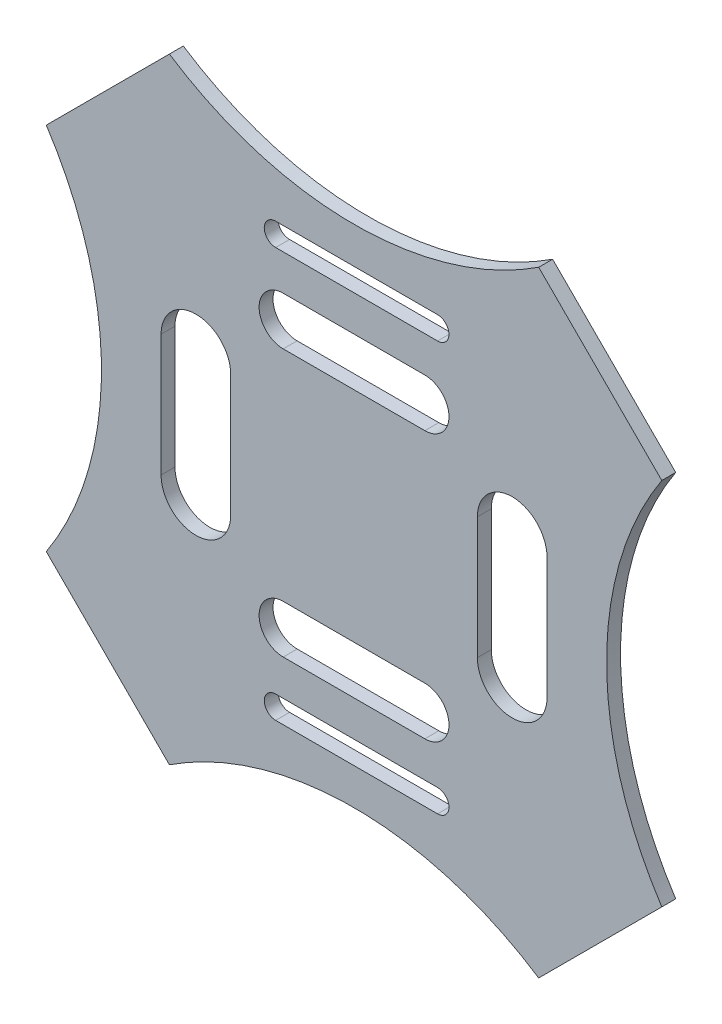
ISO-10303-21;
HEADER;
FILE_DESCRIPTION(('STEP AP214'),'2;1');
FILE_NAME('part.step','',(''),(''),'','','');
FILE_SCHEMA(('AUTOMOTIVE_DESIGN { 1 0 10303 214 1 1 1 1 }'));
ENDSEC;
DATA;
#1=APPLICATION_CONTEXT('core data for automotive mechanical design processes');
#2=APPLICATION_PROTOCOL_DEFINITION('international standard','automotive_design',2000,#1);
#3=PRODUCT_CONTEXT('',#1,'mechanical');
#4=PRODUCT('Part','Part','',(#3));
#5=PRODUCT_RELATED_PRODUCT_CATEGORY('part','',(#4));
#6=PRODUCT_DEFINITION_FORMATION('','',#4);
#7=PRODUCT_DEFINITION_CONTEXT('part definition',#1,'design');
#8=PRODUCT_DEFINITION('design','',#6,#7);
#9=PRODUCT_DEFINITION_SHAPE('','',#8);
#10=(LENGTH_UNIT() NAMED_UNIT(*) SI_UNIT(.MILLI.,.METRE.));
#11=(NAMED_UNIT(*) PLANE_ANGLE_UNIT() SI_UNIT($,.RADIAN.));
#12=(NAMED_UNIT(*) SI_UNIT($,.STERADIAN.) SOLID_ANGLE_UNIT());
#13=UNCERTAINTY_MEASURE_WITH_UNIT(LENGTH_MEASURE(1.E-05),#10,'distance_accuracy_value','');
#14=(GEOMETRIC_REPRESENTATION_CONTEXT(3) GLOBAL_UNCERTAINTY_ASSIGNED_CONTEXT((#13)) GLOBAL_UNIT_ASSIGNED_CONTEXT((#10,
#11,#12)) REPRESENTATION_CONTEXT('',''));
#15=CARTESIAN_POINT('',(0.,0.,0.));
#16=DIRECTION('',(0.,0.,1.));
#17=DIRECTION('',(1.,0.,0.));
#18=AXIS2_PLACEMENT_3D('',#15,#16,#17);
#19=CARTESIAN_POINT('',(0.,84.5998532410874,2.));
#20=DIRECTION('',(0.,0.,-1.));
#21=DIRECTION('',(-1.,0.,0.));
#22=AXIS2_PLACEMENT_3D('',#19,#20,#21);
#23=CYLINDRICAL_SURFACE('',#22,48.3295347499184);
#24=CARTESIAN_POINT('',(0.,84.5998532410874,0.));
#25=DIRECTION('',(0.,0.,1.));
#26=DIRECTION('',(1.,0.,0.));
#27=AXIS2_PLACEMENT_3D('',#24,#25,#26);
#28=CIRCLE('',#27,48.3295347499184);
#29=CARTESIAN_POINT('',(-26.5165042944955,44.1941738241592,0.));
#30=VERTEX_POINT('',#29);
#31=CARTESIAN_POINT('',(26.5165042944955,44.1941738241592,0.));
#32=VERTEX_POINT('',#31);
#33=EDGE_CURVE('E426',#30,#32,#28,.T.);
#34=ORIENTED_EDGE('',*,*,#33,.F.);
#35=DIRECTION('',(0.,0.,-1.));
#36=VECTOR('',#35,1.);
#37=CARTESIAN_POINT('',(-26.5165042944955,44.1941738241592,2.));
#38=LINE('',#37,#36);
#39=CARTESIAN_POINT('',(-26.5165042944955,44.1941738241592,2.));
#40=VERTEX_POINT('',#39);
#41=EDGE_CURVE('E11',#40,#30,#38,.T.);
#42=ORIENTED_EDGE('',*,*,#41,.F.);
#43=CARTESIAN_POINT('',(0.,84.5998532410874,2.));
#44=DIRECTION('',(0.,0.,1.));
#45=DIRECTION('',(1.,0.,0.));
#46=AXIS2_PLACEMENT_3D('',#43,#44,#45);
#47=CIRCLE('',#46,48.3295347499184);
#48=CARTESIAN_POINT('',(26.5165042944955,44.1941738241592,2.));
#49=VERTEX_POINT('',#48);
#50=EDGE_CURVE('E427',#40,#49,#47,.T.);
#51=ORIENTED_EDGE('',*,*,#50,.T.);
#52=DIRECTION('',(0.,0.,-1.));
#53=VECTOR('',#52,1.);
#54=CARTESIAN_POINT('',(26.5165042944955,44.1941738241592,2.));
#55=LINE('',#54,#53);
#56=EDGE_CURVE('E448',#49,#32,#55,.T.);
#57=ORIENTED_EDGE('',*,*,#56,.T.);
#58=EDGE_LOOP('',(#34,#42,#51,#57));
#59=FACE_BOUND('',#58,.T.);
#60=ADVANCED_FACE('F39',(#59),#23,.F.);
#61=CARTESIAN_POINT('',(-35.3553390593274,35.3553390593274,2.));
#62=DIRECTION('',(0.707106781186548,-0.707106781186547,0.));
#63=DIRECTION('',(0.707106781186547,0.707106781186548,0.));
#64=AXIS2_PLACEMENT_3D('',#61,#62,#63);
#65=PLANE('',#64);
#66=DIRECTION('',(-0.707106781186547,-0.707106781186548,0.));
#67=VECTOR('',#66,1.);
#68=CARTESIAN_POINT('',(-35.3553390593274,35.3553390593274,0.));
#69=LINE('',#68,#67);
#70=CARTESIAN_POINT('',(-44.1941738241592,26.5165042944955,0.));
#71=VERTEX_POINT('',#70);
#72=EDGE_CURVE('E451',#30,#71,#69,.T.);
#73=ORIENTED_EDGE('',*,*,#72,.T.);
#74=DIRECTION('',(0.,0.,-1.));
#75=VECTOR('',#74,1.);
#76=CARTESIAN_POINT('',(-44.1941738241592,26.5165042944955,2.));
#77=LINE('',#76,#75);
#78=CARTESIAN_POINT('',(-44.1941738241592,26.5165042944955,2.));
#79=VERTEX_POINT('',#78);
#80=EDGE_CURVE('E46',#79,#71,#77,.T.);
#81=ORIENTED_EDGE('',*,*,#80,.F.);
#82=DIRECTION('',(-0.707106781186547,-0.707106781186548,0.));
#83=VECTOR('',#82,1.);
#84=CARTESIAN_POINT('',(-35.3553390593274,35.3553390593274,2.));
#85=LINE('',#84,#83);
#86=EDGE_CURVE('E430',#40,#79,#85,.T.);
#87=ORIENTED_EDGE('',*,*,#86,.F.);
#88=ORIENTED_EDGE('',*,*,#41,.T.);
#89=EDGE_LOOP('',(#73,#81,#87,#88));
#90=FACE_BOUND('',#89,.T.);
#91=ADVANCED_FACE('F504',(#90),#65,.F.);
#92=CARTESIAN_POINT('',(-84.5998532410874,0.,2.));
#93=DIRECTION('',(0.,0.,-1.));
#94=DIRECTION('',(-1.,0.,0.));
#95=AXIS2_PLACEMENT_3D('',#92,#93,#94);
#96=CYLINDRICAL_SURFACE('',#95,48.3295347499185);
#97=CARTESIAN_POINT('',(-84.5998532410874,0.,0.));
#98=DIRECTION('',(0.,0.,1.));
#99=DIRECTION('',(1.,0.,0.));
#100=AXIS2_PLACEMENT_3D('',#97,#98,#99);
#101=CIRCLE('',#100,48.3295347499185);
#102=CARTESIAN_POINT('',(-44.1941738241592,-26.5165042944955,0.));
#103=VERTEX_POINT('',#102);
#104=EDGE_CURVE('E453',#71,#103,#101,.F.);
#105=ORIENTED_EDGE('',*,*,#104,.T.);
#106=DIRECTION('',(0.,0.,-1.));
#107=VECTOR('',#106,1.);
#108=CARTESIAN_POINT('',(-44.1941738241592,-26.5165042944955,2.));
#109=LINE('',#108,#107);
#110=CARTESIAN_POINT('',(-44.1941738241592,-26.5165042944955,2.));
#111=VERTEX_POINT('',#110);
#112=EDGE_CURVE('E479',#111,#103,#109,.T.);
#113=ORIENTED_EDGE('',*,*,#112,.F.);
#114=CARTESIAN_POINT('',(-84.5998532410874,0.,2.));
#115=DIRECTION('',(0.,0.,1.));
#116=DIRECTION('',(1.,0.,0.));
#117=AXIS2_PLACEMENT_3D('',#114,#115,#116);
#118=CIRCLE('',#117,48.3295347499185);
#119=EDGE_CURVE('E433',#79,#111,#118,.F.);
#120=ORIENTED_EDGE('',*,*,#119,.F.);
#121=ORIENTED_EDGE('',*,*,#80,.T.);
#122=EDGE_LOOP('',(#105,#113,#120,#121));
#123=FACE_BOUND('',#122,.T.);
#124=ADVANCED_FACE('F485',(#123),#96,.F.);
#125=CARTESIAN_POINT('',(-35.3553390593274,-35.3553390593274,2.));
#126=DIRECTION('',(-0.707106781186547,-0.707106781186548,0.));
#127=DIRECTION('',(0.707106781186548,-0.707106781186547,0.));
#128=AXIS2_PLACEMENT_3D('',#125,#126,#127);
#129=PLANE('',#128);
#130=DIRECTION('',(-0.707106781186548,0.707106781186547,0.));
#131=VECTOR('',#130,1.);
#132=CARTESIAN_POINT('',(-35.3553390593274,-35.3553390593274,0.));
#133=LINE('',#132,#131);
#134=CARTESIAN_POINT('',(-26.5165042944955,-44.1941738241592,0.));
#135=VERTEX_POINT('',#134);
#136=EDGE_CURVE('E456',#135,#103,#133,.T.);
#137=ORIENTED_EDGE('',*,*,#136,.F.);
#138=DIRECTION('',(0.,0.,-1.));
#139=VECTOR('',#138,1.);
#140=CARTESIAN_POINT('',(-26.5165042944955,-44.1941738241592,2.));
#141=LINE('',#140,#139);
#142=CARTESIAN_POINT('',(-26.5165042944955,-44.1941738241592,2.));
#143=VERTEX_POINT('',#142);
#144=EDGE_CURVE('E477',#143,#135,#141,.T.);
#145=ORIENTED_EDGE('',*,*,#144,.F.);
#146=DIRECTION('',(-0.707106781186548,0.707106781186547,0.));
#147=VECTOR('',#146,1.);
#148=CARTESIAN_POINT('',(-35.3553390593274,-35.3553390593274,2.));
#149=LINE('',#148,#147);
#150=EDGE_CURVE('E435',#143,#111,#149,.T.);
#151=ORIENTED_EDGE('',*,*,#150,.T.);
#152=ORIENTED_EDGE('',*,*,#112,.T.);
#153=EDGE_LOOP('',(#137,#145,#151,#152));
#154=FACE_BOUND('',#153,.T.);
#155=ADVANCED_FACE('F496',(#154),#129,.T.);
#156=CARTESIAN_POINT('',(0.,-84.5998532410874,2.));
#157=DIRECTION('',(0.,0.,-1.));
#158=DIRECTION('',(-1.,0.,0.));
#159=AXIS2_PLACEMENT_3D('',#156,#157,#158);
#160=CYLINDRICAL_SURFACE('',#159,48.3295347499185);
#161=CARTESIAN_POINT('',(0.,-84.5998532410874,0.));
#162=DIRECTION('',(0.,0.,1.));
#163=DIRECTION('',(1.,0.,0.));
#164=AXIS2_PLACEMENT_3D('',#161,#162,#163);
#165=CIRCLE('',#164,48.3295347499185);
#166=CARTESIAN_POINT('',(26.5165042944955,-44.1941738241592,0.));
#167=VERTEX_POINT('',#166);
#168=EDGE_CURVE('E459',#135,#167,#165,.F.);
#169=ORIENTED_EDGE('',*,*,#168,.T.);
#170=DIRECTION('',(0.,0.,-1.));
#171=VECTOR('',#170,1.);
#172=CARTESIAN_POINT('',(26.5165042944955,-44.1941738241592,2.));
#173=LINE('',#172,#171);
#174=CARTESIAN_POINT('',(26.5165042944955,-44.1941738241592,2.));
#175=VERTEX_POINT('',#174);
#176=EDGE_CURVE('E474',#175,#167,#173,.T.);
#177=ORIENTED_EDGE('',*,*,#176,.F.);
#178=CARTESIAN_POINT('',(0.,-84.5998532410874,2.));
#179=DIRECTION('',(0.,0.,1.));
#180=DIRECTION('',(1.,0.,0.));
#181=AXIS2_PLACEMENT_3D('',#178,#179,#180);
#182=CIRCLE('',#181,48.3295347499185);
#183=EDGE_CURVE('E438',#143,#175,#182,.F.);
#184=ORIENTED_EDGE('',*,*,#183,.F.);
#185=ORIENTED_EDGE('',*,*,#144,.T.);
#186=EDGE_LOOP('',(#169,#177,#184,#185));
#187=FACE_BOUND('',#186,.T.);
#188=ADVANCED_FACE('F518',(#187),#160,.F.);
#189=CARTESIAN_POINT('',(35.3553390593274,-35.3553390593274,2.));
#190=DIRECTION('',(-0.707106781186548,0.707106781186547,0.));
#191=DIRECTION('',(-0.707106781186547,-0.707106781186548,0.));
#192=AXIS2_PLACEMENT_3D('',#189,#190,#191);
#193=PLANE('',#192);
#194=DIRECTION('',(0.707106781186547,0.707106781186548,0.));
#195=VECTOR('',#194,1.);
#196=CARTESIAN_POINT('',(35.3553390593274,-35.3553390593274,0.));
#197=LINE('',#196,#195);
#198=CARTESIAN_POINT('',(44.1941738241592,-26.5165042944955,0.));
#199=VERTEX_POINT('',#198);
#200=EDGE_CURVE('E461',#167,#199,#197,.T.);
#201=ORIENTED_EDGE('',*,*,#200,.T.);
#202=DIRECTION('',(0.,0.,-1.));
#203=VECTOR('',#202,1.);
#204=CARTESIAN_POINT('',(44.1941738241592,-26.5165042944955,2.));
#205=LINE('',#204,#203);
#206=CARTESIAN_POINT('',(44.1941738241592,-26.5165042944955,2.));
#207=VERTEX_POINT('',#206);
#208=EDGE_CURVE('E472',#207,#199,#205,.T.);
#209=ORIENTED_EDGE('',*,*,#208,.F.);
#210=DIRECTION('',(0.707106781186547,0.707106781186548,0.));
#211=VECTOR('',#210,1.);
#212=CARTESIAN_POINT('',(35.3553390593274,-35.3553390593274,2.));
#213=LINE('',#212,#211);
#214=EDGE_CURVE('E440',#175,#207,#213,.T.);
#215=ORIENTED_EDGE('',*,*,#214,.F.);
#216=ORIENTED_EDGE('',*,*,#176,.T.);
#217=EDGE_LOOP('',(#201,#209,#215,#216));
#218=FACE_BOUND('',#217,.T.);
#219=ADVANCED_FACE('F515',(#218),#193,.F.);
#220=CARTESIAN_POINT('',(84.5998532410874,0.,2.));
#221=DIRECTION('',(0.,0.,-1.));
#222=DIRECTION('',(-1.,0.,0.));
#223=AXIS2_PLACEMENT_3D('',#220,#221,#222);
#224=CYLINDRICAL_SURFACE('',#223,48.3295347499184);
#225=CARTESIAN_POINT('',(84.5998532410874,0.,0.));
#226=DIRECTION('',(0.,0.,1.));
#227=DIRECTION('',(1.,0.,0.));
#228=AXIS2_PLACEMENT_3D('',#225,#226,#227);
#229=CIRCLE('',#228,48.3295347499184);
#230=CARTESIAN_POINT('',(44.1941738241592,26.5165042944956,0.));
#231=VERTEX_POINT('',#230);
#232=EDGE_CURVE('E464',#231,#199,#229,.T.);
#233=ORIENTED_EDGE('',*,*,#232,.F.);
#234=DIRECTION('',(0.,0.,-1.));
#235=VECTOR('',#234,1.);
#236=CARTESIAN_POINT('',(44.1941738241592,26.5165042944956,2.));
#237=LINE('',#236,#235);
#238=CARTESIAN_POINT('',(44.1941738241592,26.5165042944956,2.));
#239=VERTEX_POINT('',#238);
#240=EDGE_CURVE('E470',#239,#231,#237,.T.);
#241=ORIENTED_EDGE('',*,*,#240,.F.);
#242=CARTESIAN_POINT('',(84.5998532410874,0.,2.));
#243=DIRECTION('',(0.,0.,1.));
#244=DIRECTION('',(1.,0.,0.));
#245=AXIS2_PLACEMENT_3D('',#242,#243,#244);
#246=CIRCLE('',#245,48.3295347499184);
#247=EDGE_CURVE('E442',#239,#207,#246,.T.);
#248=ORIENTED_EDGE('',*,*,#247,.T.);
#249=ORIENTED_EDGE('',*,*,#208,.T.);
#250=EDGE_LOOP('',(#233,#241,#248,#249));
#251=FACE_BOUND('',#250,.T.);
#252=ADVANCED_FACE('F512',(#251),#224,.F.);
#253=CARTESIAN_POINT('',(35.3553390593274,35.3553390593274,2.));
#254=DIRECTION('',(0.707106781186547,0.707106781186548,0.));
#255=DIRECTION('',(-0.707106781186548,0.707106781186547,0.));
#256=AXIS2_PLACEMENT_3D('',#253,#254,#255);
#257=PLANE('',#256);
#258=DIRECTION('',(0.707106781186548,-0.707106781186547,0.));
#259=VECTOR('',#258,1.);
#260=CARTESIAN_POINT('',(35.3553390593274,35.3553390593274,0.));
#261=LINE('',#260,#259);
#262=EDGE_CURVE('E431',#32,#231,#261,.T.);
#263=ORIENTED_EDGE('',*,*,#262,.F.);
#264=ORIENTED_EDGE('',*,*,#56,.F.);
#265=DIRECTION('',(0.707106781186548,-0.707106781186547,0.));
#266=VECTOR('',#265,1.);
#267=CARTESIAN_POINT('',(35.3553390593274,35.3553390593274,2.));
#268=LINE('',#267,#266);
#269=EDGE_CURVE('E445',#49,#239,#268,.T.);
#270=ORIENTED_EDGE('',*,*,#269,.T.);
#271=ORIENTED_EDGE('',*,*,#240,.T.);
#272=EDGE_LOOP('',(#263,#264,#270,#271));
#273=FACE_BOUND('',#272,.T.);
#274=ADVANCED_FACE('F508',(#273),#257,.T.);
#275=CARTESIAN_POINT('',(0.,0.,2.));
#276=DIRECTION('',(0.,0.,1.));
#277=DIRECTION('',(1.,0.,0.));
#278=AXIS2_PLACEMENT_3D('',#275,#276,#277);
#279=PLANE('',#278);
#280=CARTESIAN_POINT('',(11.9939289647254,-29.4023943991028,2.));
#281=DIRECTION('',(0.,0.,1.));
#282=DIRECTION('',(1.,0.,0.));
#283=AXIS2_PLACEMENT_3D('',#280,#281,#282);
#284=CIRCLE('',#283,1.63743450039893);
#285=CARTESIAN_POINT('',(11.9939289647254,-31.0398288995017,2.));
#286=VERTEX_POINT('',#285);
#287=CARTESIAN_POINT('',(11.9939289647254,-27.7649598987039,2.));
#288=VERTEX_POINT('',#287);
#289=EDGE_CURVE('E279',#286,#288,#284,.T.);
#290=ORIENTED_EDGE('',*,*,#289,.F.);
#291=DIRECTION('',(1.,0.,0.));
#292=VECTOR('',#291,1.);
#293=CARTESIAN_POINT('',(0.,-31.0398288995017,2.));
#294=LINE('',#293,#292);
#295=CARTESIAN_POINT('',(-11.2563574939603,-31.0398288995017,2.));
#296=VERTEX_POINT('',#295);
#297=EDGE_CURVE('E272',#296,#286,#294,.T.);
#298=ORIENTED_EDGE('',*,*,#297,.F.);
#299=CARTESIAN_POINT('',(-11.2563574939603,-29.4023943991028,2.));
#300=DIRECTION('',(0.,0.,1.));
#301=DIRECTION('',(1.,0.,0.));
#302=AXIS2_PLACEMENT_3D('',#299,#300,#301);
#303=CIRCLE('',#302,1.63743450039893);
#304=CARTESIAN_POINT('',(-11.2563574939603,-27.7649598987039,2.));
#305=VERTEX_POINT('',#304);
#306=EDGE_CURVE('E252',#305,#296,#303,.T.);
#307=ORIENTED_EDGE('',*,*,#306,.F.);
#308=DIRECTION('',(-1.,0.,0.));
#309=VECTOR('',#308,1.);
#310=CARTESIAN_POINT('',(0.,-27.7649598987039,2.));
#311=LINE('',#310,#309);
#312=EDGE_CURVE('E277',#288,#305,#311,.T.);
#313=ORIENTED_EDGE('',*,*,#312,.F.);
#314=EDGE_LOOP('',(#290,#298,#307,#313));
#315=FACE_BOUND('',#314,.T.);
#316=CARTESIAN_POINT('',(10.1716423481787,-19.1609914473721,2.));
#317=DIRECTION('',(0.,0.,1.));
#318=DIRECTION('',(1.,0.,0.));
#319=AXIS2_PLACEMENT_3D('',#316,#317,#318);
#320=CIRCLE('',#319,3.4597211169456);
#321=CARTESIAN_POINT('',(10.1716423481787,-22.6207125643177,2.));
#322=VERTEX_POINT('',#321);
#323=CARTESIAN_POINT('',(10.1716423481787,-15.7012703304265,2.));
#324=VERTEX_POINT('',#323);
#325=EDGE_CURVE('E308',#322,#324,#320,.T.);
#326=ORIENTED_EDGE('',*,*,#325,.F.);
#327=DIRECTION('',(1.,0.,0.));
#328=VECTOR('',#327,1.);
#329=CARTESIAN_POINT('',(0.,-22.6207125643177,2.));
#330=LINE('',#329,#328);
#331=CARTESIAN_POINT('',(-10.1716423481788,-22.6207125643177,2.));
#332=VERTEX_POINT('',#331);
#333=EDGE_CURVE('E295',#332,#322,#330,.T.);
#334=ORIENTED_EDGE('',*,*,#333,.F.);
#335=CARTESIAN_POINT('',(-10.1716423481788,-19.1609914473721,2.));
#336=DIRECTION('',(0.,0.,1.));
#337=DIRECTION('',(1.,0.,0.));
#338=AXIS2_PLACEMENT_3D('',#335,#336,#337);
#339=CIRCLE('',#338,3.4597211169456);
#340=CARTESIAN_POINT('',(-10.1716423481788,-15.7012703304265,2.));
#341=VERTEX_POINT('',#340);
#342=EDGE_CURVE('E303',#341,#332,#339,.T.);
#343=ORIENTED_EDGE('',*,*,#342,.F.);
#344=DIRECTION('',(-1.,0.,0.));
#345=VECTOR('',#344,1.);
#346=CARTESIAN_POINT('',(0.,-15.7012703304265,2.));
#347=LINE('',#346,#345);
#348=EDGE_CURVE('E306',#324,#341,#347,.T.);
#349=ORIENTED_EDGE('',*,*,#348,.F.);
#350=EDGE_LOOP('',(#326,#334,#343,#349));
#351=FACE_BOUND('',#350,.T.);
#352=CARTESIAN_POINT('',(11.9939289647254,29.4023943991028,2.));
#353=DIRECTION('',(0.,0.,1.));
#354=DIRECTION('',(1.,0.,0.));
#355=AXIS2_PLACEMENT_3D('',#352,#353,#354);
#356=CIRCLE('',#355,1.63743450039893);
#357=CARTESIAN_POINT('',(11.9939289647254,27.7649598987039,2.));
#358=VERTEX_POINT('',#357);
#359=CARTESIAN_POINT('',(11.9939289647254,31.0398288995017,2.));
#360=VERTEX_POINT('',#359);
#361=EDGE_CURVE('E337',#358,#360,#356,.T.);
#362=ORIENTED_EDGE('',*,*,#361,.F.);
#363=DIRECTION('',(1.,0.,0.));
#364=VECTOR('',#363,1.);
#365=CARTESIAN_POINT('',(0.,27.7649598987039,2.));
#366=LINE('',#365,#364);
#367=CARTESIAN_POINT('',(-11.2563574939603,27.7649598987039,2.));
#368=VERTEX_POINT('',#367);
#369=EDGE_CURVE('E324',#368,#358,#366,.T.);
#370=ORIENTED_EDGE('',*,*,#369,.F.);
#371=CARTESIAN_POINT('',(-11.2563574939603,29.4023943991028,2.));
#372=DIRECTION('',(0.,0.,1.));
#373=DIRECTION('',(1.,0.,0.));
#374=AXIS2_PLACEMENT_3D('',#371,#372,#373);
#375=CIRCLE('',#374,1.63743450039893);
#376=CARTESIAN_POINT('',(-11.2563574939603,31.0398288995017,2.));
#377=VERTEX_POINT('',#376);
#378=EDGE_CURVE('E332',#377,#368,#375,.T.);
#379=ORIENTED_EDGE('',*,*,#378,.F.);
#380=DIRECTION('',(-1.,0.,0.));
#381=VECTOR('',#380,1.);
#382=CARTESIAN_POINT('',(0.,31.0398288995017,2.));
#383=LINE('',#382,#381);
#384=EDGE_CURVE('E335',#360,#377,#383,.T.);
#385=ORIENTED_EDGE('',*,*,#384,.F.);
#386=EDGE_LOOP('',(#362,#370,#379,#385));
#387=FACE_BOUND('',#386,.T.);
#388=CARTESIAN_POINT('',(10.1716423481787,19.1609914473721,2.));
#389=DIRECTION('',(0.,0.,1.));
#390=DIRECTION('',(1.,0.,0.));
#391=AXIS2_PLACEMENT_3D('',#388,#389,#390);
#392=CIRCLE('',#391,3.4597211169456);
#393=CARTESIAN_POINT('',(10.1716423481787,15.7012703304265,2.));
#394=VERTEX_POINT('',#393);
#395=CARTESIAN_POINT('',(10.1716423481787,22.6207125643177,2.));
#396=VERTEX_POINT('',#395);
#397=EDGE_CURVE('E366',#394,#396,#392,.T.);
#398=ORIENTED_EDGE('',*,*,#397,.F.);
#399=DIRECTION('',(1.,0.,0.));
#400=VECTOR('',#399,1.);
#401=CARTESIAN_POINT('',(0.,15.7012703304265,2.));
#402=LINE('',#401,#400);
#403=CARTESIAN_POINT('',(-10.1716423481788,15.7012703304265,2.));
#404=VERTEX_POINT('',#403);
#405=EDGE_CURVE('E353',#404,#394,#402,.T.);
#406=ORIENTED_EDGE('',*,*,#405,.F.);
#407=CARTESIAN_POINT('',(-10.1716423481788,19.1609914473721,2.));
#408=DIRECTION('',(0.,0.,1.));
#409=DIRECTION('',(1.,0.,0.));
#410=AXIS2_PLACEMENT_3D('',#407,#408,#409);
#411=CIRCLE('',#410,3.4597211169456);
#412=CARTESIAN_POINT('',(-10.1716423481788,22.6207125643177,2.));
#413=VERTEX_POINT('',#412);
#414=EDGE_CURVE('E361',#413,#404,#411,.T.);
#415=ORIENTED_EDGE('',*,*,#414,.F.);
#416=DIRECTION('',(-1.,0.,0.));
#417=VECTOR('',#416,1.);
#418=CARTESIAN_POINT('',(0.,22.6207125643177,2.));
#419=LINE('',#418,#417);
#420=EDGE_CURVE('E364',#396,#413,#419,.T.);
#421=ORIENTED_EDGE('',*,*,#420,.F.);
#422=EDGE_LOOP('',(#398,#406,#415,#421));
#423=FACE_BOUND('',#422,.T.);
#424=CARTESIAN_POINT('',(-22.7087565006061,-8.75750726125976,2.));
#425=DIRECTION('',(0.,0.,1.));
#426=DIRECTION('',(1.,0.,0.));
#427=AXIS2_PLACEMENT_3D('',#424,#425,#426);
#428=CIRCLE('',#427,5.);
#429=CARTESIAN_POINT('',(-27.7087565006062,-8.75750726125975,2.));
#430=VERTEX_POINT('',#429);
#431=CARTESIAN_POINT('',(-17.7087565006062,-8.75750726125976,2.));
#432=VERTEX_POINT('',#431);
#433=EDGE_CURVE('E395',#430,#432,#428,.T.);
#434=ORIENTED_EDGE('',*,*,#433,.F.);
#435=DIRECTION('',(0.,-1.,0.));
#436=VECTOR('',#435,1.);
#437=CARTESIAN_POINT('',(-27.7087565006062,0.,2.));
#438=LINE('',#437,#436);
#439=CARTESIAN_POINT('',(-27.7087565006062,8.75750726125975,2.));
#440=VERTEX_POINT('',#439);
#441=EDGE_CURVE('E382',#440,#430,#438,.T.);
#442=ORIENTED_EDGE('',*,*,#441,.F.);
#443=CARTESIAN_POINT('',(-22.7087565006061,8.75750726125976,2.));
#444=DIRECTION('',(0.,0.,1.));
#445=DIRECTION('',(1.,0.,0.));
#446=AXIS2_PLACEMENT_3D('',#443,#444,#445);
#447=CIRCLE('',#446,5.);
#448=CARTESIAN_POINT('',(-17.7087565006061,8.75750726125976,2.));
#449=VERTEX_POINT('',#448);
#450=EDGE_CURVE('E390',#449,#440,#447,.T.);
#451=ORIENTED_EDGE('',*,*,#450,.F.);
#452=DIRECTION('',(0.,1.,0.));
#453=VECTOR('',#452,1.);
#454=CARTESIAN_POINT('',(-17.7087565006062,0.,2.));
#455=LINE('',#454,#453);
#456=EDGE_CURVE('E393',#432,#449,#455,.T.);
#457=ORIENTED_EDGE('',*,*,#456,.F.);
#458=EDGE_LOOP('',(#434,#442,#451,#457));
#459=FACE_BOUND('',#458,.T.);
#460=CARTESIAN_POINT('',(22.7087565006061,-8.75750726125976,2.));
#461=DIRECTION('',(0.,0.,1.));
#462=DIRECTION('',(1.,0.,0.));
#463=AXIS2_PLACEMENT_3D('',#460,#461,#462);
#464=CIRCLE('',#463,4.99999999999999);
#465=CARTESIAN_POINT('',(17.7087565006061,-8.75750726125977,2.));
#466=VERTEX_POINT('',#465);
#467=CARTESIAN_POINT('',(27.7087565006061,-8.75750726125975,2.));
#468=VERTEX_POINT('',#467);
#469=EDGE_CURVE('E424',#466,#468,#464,.T.);
#470=ORIENTED_EDGE('',*,*,#469,.F.);
#471=DIRECTION('',(0.,-1.,0.));
#472=VECTOR('',#471,1.);
#473=CARTESIAN_POINT('',(17.7087565006061,0.,2.));
#474=LINE('',#473,#472);
#475=CARTESIAN_POINT('',(17.7087565006061,8.75750726125977,2.));
#476=VERTEX_POINT('',#475);
#477=EDGE_CURVE('E411',#476,#466,#474,.T.);
#478=ORIENTED_EDGE('',*,*,#477,.F.);
#479=CARTESIAN_POINT('',(22.7087565006061,8.75750726125976,2.));
#480=DIRECTION('',(0.,0.,1.));
#481=DIRECTION('',(1.,0.,0.));
#482=AXIS2_PLACEMENT_3D('',#479,#480,#481);
#483=CIRCLE('',#482,4.99999999999999);
#484=CARTESIAN_POINT('',(27.7087565006061,8.75750726125975,2.));
#485=VERTEX_POINT('',#484);
#486=EDGE_CURVE('E419',#485,#476,#483,.T.);
#487=ORIENTED_EDGE('',*,*,#486,.F.);
#488=DIRECTION('',(0.,1.,0.));
#489=VECTOR('',#488,1.);
#490=CARTESIAN_POINT('',(27.7087565006061,0.,2.));
#491=LINE('',#490,#489);
#492=EDGE_CURVE('E422',#468,#485,#491,.T.);
#493=ORIENTED_EDGE('',*,*,#492,.F.);
#494=EDGE_LOOP('',(#470,#478,#487,#493));
#495=FACE_BOUND('',#494,.T.);
#496=ORIENTED_EDGE('',*,*,#50,.F.);
#497=ORIENTED_EDGE('',*,*,#86,.T.);
#498=ORIENTED_EDGE('',*,*,#119,.T.);
#499=ORIENTED_EDGE('',*,*,#150,.F.);
#500=ORIENTED_EDGE('',*,*,#183,.T.);
#501=ORIENTED_EDGE('',*,*,#214,.T.);
#502=ORIENTED_EDGE('',*,*,#247,.F.);
#503=ORIENTED_EDGE('',*,*,#269,.F.);
#504=EDGE_LOOP('',(#496,#497,#498,#499,#500,#501,#502,#503));
#505=FACE_BOUND('',#504,.T.);
#506=ADVANCED_FACE('F501',(#315,#351,#387,#423,#459,#495,#505),#279,.T.);
#507=CARTESIAN_POINT('',(0.,0.,0.));
#508=DIRECTION('',(0.,0.,1.));
#509=DIRECTION('',(1.,0.,0.));
#510=AXIS2_PLACEMENT_3D('',#507,#508,#509);
#511=PLANE('',#510);
#512=DIRECTION('',(-1.,0.,0.));
#513=VECTOR('',#512,1.);
#514=CARTESIAN_POINT('',(11.9939289647254,-31.0398288995017,0.));
#515=LINE('',#514,#513);
#516=CARTESIAN_POINT('',(11.9939289647254,-31.0398288995017,0.));
#517=VERTEX_POINT('',#516);
#518=CARTESIAN_POINT('',(-11.2563574939603,-31.0398288995017,0.));
#519=VERTEX_POINT('',#518);
#520=EDGE_CURVE('E258',#517,#519,#515,.T.);
#521=ORIENTED_EDGE('',*,*,#520,.F.);
#522=CARTESIAN_POINT('',(11.9939289647254,-29.4023943991028,0.));
#523=DIRECTION('',(0.,0.,-1.));
#524=DIRECTION('',(1.,0.,0.));
#525=AXIS2_PLACEMENT_3D('',#522,#523,#524);
#526=CIRCLE('',#525,1.63743450039893);
#527=CARTESIAN_POINT('',(11.9939289647254,-27.7649598987039,0.));
#528=VERTEX_POINT('',#527);
#529=EDGE_CURVE('E61',#528,#517,#526,.T.);
#530=ORIENTED_EDGE('',*,*,#529,.F.);
#531=DIRECTION('',(1.,0.,0.));
#532=VECTOR('',#531,1.);
#533=CARTESIAN_POINT('',(11.9939289647254,-27.7649598987039,0.));
#534=LINE('',#533,#532);
#535=CARTESIAN_POINT('',(-11.2563574939603,-27.7649598987039,0.));
#536=VERTEX_POINT('',#535);
#537=EDGE_CURVE('E265',#536,#528,#534,.T.);
#538=ORIENTED_EDGE('',*,*,#537,.F.);
#539=CARTESIAN_POINT('',(-11.2563574939603,-29.4023943991028,0.));
#540=DIRECTION('',(0.,0.,-1.));
#541=DIRECTION('',(1.,0.,0.));
#542=AXIS2_PLACEMENT_3D('',#539,#540,#541);
#543=CIRCLE('',#542,1.63743450039893);
#544=EDGE_CURVE('E249',#519,#536,#543,.T.);
#545=ORIENTED_EDGE('',*,*,#544,.F.);
#546=EDGE_LOOP('',(#521,#530,#538,#545));
#547=FACE_BOUND('',#546,.T.);
#548=DIRECTION('',(-1.,0.,0.));
#549=VECTOR('',#548,1.);
#550=CARTESIAN_POINT('',(10.1716423481787,-22.6207125643177,0.));
#551=LINE('',#550,#549);
#552=CARTESIAN_POINT('',(10.1716423481787,-22.6207125643177,0.));
#553=VERTEX_POINT('',#552);
#554=CARTESIAN_POINT('',(-10.1716423481788,-22.6207125643177,0.));
#555=VERTEX_POINT('',#554);
#556=EDGE_CURVE('E283',#553,#555,#551,.T.);
#557=ORIENTED_EDGE('',*,*,#556,.F.);
#558=CARTESIAN_POINT('',(10.1716423481787,-19.1609914473721,0.));
#559=DIRECTION('',(0.,0.,-1.));
#560=DIRECTION('',(1.,0.,0.));
#561=AXIS2_PLACEMENT_3D('',#558,#559,#560);
#562=CIRCLE('',#561,3.4597211169456);
#563=CARTESIAN_POINT('',(10.1716423481787,-15.7012703304265,0.));
#564=VERTEX_POINT('',#563);
#565=EDGE_CURVE('E281',#564,#553,#562,.T.);
#566=ORIENTED_EDGE('',*,*,#565,.F.);
#567=DIRECTION('',(1.,0.,0.));
#568=VECTOR('',#567,1.);
#569=CARTESIAN_POINT('',(10.1716423481787,-15.7012703304265,0.));
#570=LINE('',#569,#568);
#571=CARTESIAN_POINT('',(-10.1716423481788,-15.7012703304265,0.));
#572=VERTEX_POINT('',#571);
#573=EDGE_CURVE('E289',#572,#564,#570,.T.);
#574=ORIENTED_EDGE('',*,*,#573,.F.);
#575=CARTESIAN_POINT('',(-10.1716423481788,-19.1609914473721,0.));
#576=DIRECTION('',(0.,0.,-1.));
#577=DIRECTION('',(1.,0.,0.));
#578=AXIS2_PLACEMENT_3D('',#575,#576,#577);
#579=CIRCLE('',#578,3.4597211169456);
#580=EDGE_CURVE('E286',#555,#572,#579,.T.);
#581=ORIENTED_EDGE('',*,*,#580,.F.);
#582=EDGE_LOOP('',(#557,#566,#574,#581));
#583=FACE_BOUND('',#582,.T.);
#584=DIRECTION('',(-1.,0.,0.));
#585=VECTOR('',#584,1.);
#586=CARTESIAN_POINT('',(11.9939289647254,27.7649598987039,0.));
#587=LINE('',#586,#585);
#588=CARTESIAN_POINT('',(11.9939289647254,27.7649598987039,0.));
#589=VERTEX_POINT('',#588);
#590=CARTESIAN_POINT('',(-11.2563574939603,27.7649598987039,0.));
#591=VERTEX_POINT('',#590);
#592=EDGE_CURVE('E312',#589,#591,#587,.T.);
#593=ORIENTED_EDGE('',*,*,#592,.F.);
#594=CARTESIAN_POINT('',(11.9939289647254,29.4023943991028,0.));
#595=DIRECTION('',(0.,0.,-1.));
#596=DIRECTION('',(-1.,0.,0.));
#597=AXIS2_PLACEMENT_3D('',#594,#595,#596);
#598=CIRCLE('',#597,1.63743450039893);
#599=CARTESIAN_POINT('',(11.9939289647254,31.0398288995017,0.));
#600=VERTEX_POINT('',#599);
#601=EDGE_CURVE('E310',#600,#589,#598,.T.);
#602=ORIENTED_EDGE('',*,*,#601,.F.);
#603=DIRECTION('',(1.,0.,0.));
#604=VECTOR('',#603,1.);
#605=CARTESIAN_POINT('',(11.9939289647254,31.0398288995017,0.));
#606=LINE('',#605,#604);
#607=CARTESIAN_POINT('',(-11.2563574939603,31.0398288995017,0.));
#608=VERTEX_POINT('',#607);
#609=EDGE_CURVE('E318',#608,#600,#606,.T.);
#610=ORIENTED_EDGE('',*,*,#609,.F.);
#611=CARTESIAN_POINT('',(-11.2563574939603,29.4023943991028,0.));
#612=DIRECTION('',(0.,0.,-1.));
#613=DIRECTION('',(-1.,0.,0.));
#614=AXIS2_PLACEMENT_3D('',#611,#612,#613);
#615=CIRCLE('',#614,1.63743450039893);
#616=EDGE_CURVE('E315',#591,#608,#615,.T.);
#617=ORIENTED_EDGE('',*,*,#616,.F.);
#618=EDGE_LOOP('',(#593,#602,#610,#617));
#619=FACE_BOUND('',#618,.T.);
#620=DIRECTION('',(-1.,0.,0.));
#621=VECTOR('',#620,1.);
#622=CARTESIAN_POINT('',(10.1716423481787,15.7012703304265,0.));
#623=LINE('',#622,#621);
#624=CARTESIAN_POINT('',(10.1716423481787,15.7012703304265,0.));
#625=VERTEX_POINT('',#624);
#626=CARTESIAN_POINT('',(-10.1716423481788,15.7012703304265,0.));
#627=VERTEX_POINT('',#626);
#628=EDGE_CURVE('E341',#625,#627,#623,.T.);
#629=ORIENTED_EDGE('',*,*,#628,.F.);
#630=CARTESIAN_POINT('',(10.1716423481787,19.1609914473721,0.));
#631=DIRECTION('',(0.,0.,-1.));
#632=DIRECTION('',(-1.,0.,0.));
#633=AXIS2_PLACEMENT_3D('',#630,#631,#632);
#634=CIRCLE('',#633,3.4597211169456);
#635=CARTESIAN_POINT('',(10.1716423481787,22.6207125643177,0.));
#636=VERTEX_POINT('',#635);
#637=EDGE_CURVE('E339',#636,#625,#634,.T.);
#638=ORIENTED_EDGE('',*,*,#637,.F.);
#639=DIRECTION('',(1.,0.,0.));
#640=VECTOR('',#639,1.);
#641=CARTESIAN_POINT('',(10.1716423481787,22.6207125643177,0.));
#642=LINE('',#641,#640);
#643=CARTESIAN_POINT('',(-10.1716423481788,22.6207125643177,0.));
#644=VERTEX_POINT('',#643);
#645=EDGE_CURVE('E347',#644,#636,#642,.T.);
#646=ORIENTED_EDGE('',*,*,#645,.F.);
#647=CARTESIAN_POINT('',(-10.1716423481788,19.1609914473721,0.));
#648=DIRECTION('',(0.,0.,-1.));
#649=DIRECTION('',(-1.,0.,0.));
#650=AXIS2_PLACEMENT_3D('',#647,#648,#649);
#651=CIRCLE('',#650,3.4597211169456);
#652=EDGE_CURVE('E344',#627,#644,#651,.T.);
#653=ORIENTED_EDGE('',*,*,#652,.F.);
#654=EDGE_LOOP('',(#629,#638,#646,#653));
#655=FACE_BOUND('',#654,.T.);
#656=DIRECTION('',(0.,1.,0.));
#657=VECTOR('',#656,1.);
#658=CARTESIAN_POINT('',(-27.7087565006062,-8.75750726125975,0.));
#659=LINE('',#658,#657);
#660=CARTESIAN_POINT('',(-27.7087565006062,-8.75750726125975,0.));
#661=VERTEX_POINT('',#660);
#662=CARTESIAN_POINT('',(-27.7087565006062,8.75750726125975,0.));
#663=VERTEX_POINT('',#662);
#664=EDGE_CURVE('E370',#661,#663,#659,.T.);
#665=ORIENTED_EDGE('',*,*,#664,.F.);
#666=CARTESIAN_POINT('',(-22.7087565006061,-8.75750726125976,0.));
#667=DIRECTION('',(0.,0.,-1.));
#668=DIRECTION('',(1.,0.,0.));
#669=AXIS2_PLACEMENT_3D('',#666,#667,#668);
#670=CIRCLE('',#669,5.);
#671=CARTESIAN_POINT('',(-17.7087565006062,-8.75750726125976,0.));
#672=VERTEX_POINT('',#671);
#673=EDGE_CURVE('E368',#672,#661,#670,.T.);
#674=ORIENTED_EDGE('',*,*,#673,.F.);
#675=DIRECTION('',(0.,-1.,0.));
#676=VECTOR('',#675,1.);
#677=CARTESIAN_POINT('',(-17.7087565006062,-8.75750726125976,0.));
#678=LINE('',#677,#676);
#679=CARTESIAN_POINT('',(-17.7087565006061,8.75750726125976,0.));
#680=VERTEX_POINT('',#679);
#681=EDGE_CURVE('E376',#680,#672,#678,.T.);
#682=ORIENTED_EDGE('',*,*,#681,.F.);
#683=CARTESIAN_POINT('',(-22.7087565006061,8.75750726125976,0.));
#684=DIRECTION('',(0.,0.,-1.));
#685=DIRECTION('',(1.,0.,0.));
#686=AXIS2_PLACEMENT_3D('',#683,#684,#685);
#687=CIRCLE('',#686,5.);
#688=EDGE_CURVE('E373',#663,#680,#687,.T.);
#689=ORIENTED_EDGE('',*,*,#688,.F.);
#690=EDGE_LOOP('',(#665,#674,#682,#689));
#691=FACE_BOUND('',#690,.T.);
#692=DIRECTION('',(0.,1.,0.));
#693=VECTOR('',#692,1.);
#694=CARTESIAN_POINT('',(17.7087565006061,-8.75750726125977,0.));
#695=LINE('',#694,#693);
#696=CARTESIAN_POINT('',(17.7087565006061,-8.75750726125977,0.));
#697=VERTEX_POINT('',#696);
#698=CARTESIAN_POINT('',(17.7087565006061,8.75750726125977,0.));
#699=VERTEX_POINT('',#698);
#700=EDGE_CURVE('E399',#697,#699,#695,.T.);
#701=ORIENTED_EDGE('',*,*,#700,.F.);
#702=CARTESIAN_POINT('',(22.7087565006061,-8.75750726125976,0.));
#703=DIRECTION('',(0.,0.,-1.));
#704=DIRECTION('',(-1.,0.,0.));
#705=AXIS2_PLACEMENT_3D('',#702,#703,#704);
#706=CIRCLE('',#705,4.99999999999999);
#707=CARTESIAN_POINT('',(27.7087565006061,-8.75750726125975,0.));
#708=VERTEX_POINT('',#707);
#709=EDGE_CURVE('E397',#708,#697,#706,.T.);
#710=ORIENTED_EDGE('',*,*,#709,.F.);
#711=DIRECTION('',(0.,-1.,0.));
#712=VECTOR('',#711,1.);
#713=CARTESIAN_POINT('',(27.7087565006061,-8.75750726125975,0.));
#714=LINE('',#713,#712);
#715=CARTESIAN_POINT('',(27.7087565006061,8.75750726125975,0.));
#716=VERTEX_POINT('',#715);
#717=EDGE_CURVE('E405',#716,#708,#714,.T.);
#718=ORIENTED_EDGE('',*,*,#717,.F.);
#719=CARTESIAN_POINT('',(22.7087565006061,8.75750726125976,0.));
#720=DIRECTION('',(0.,0.,-1.));
#721=DIRECTION('',(-1.,0.,0.));
#722=AXIS2_PLACEMENT_3D('',#719,#720,#721);
#723=CIRCLE('',#722,4.99999999999999);
#724=EDGE_CURVE('E402',#699,#716,#723,.T.);
#725=ORIENTED_EDGE('',*,*,#724,.F.);
#726=EDGE_LOOP('',(#701,#710,#718,#725));
#727=FACE_BOUND('',#726,.T.);
#728=ORIENTED_EDGE('',*,*,#33,.T.);
#729=ORIENTED_EDGE('',*,*,#262,.T.);
#730=ORIENTED_EDGE('',*,*,#232,.T.);
#731=ORIENTED_EDGE('',*,*,#200,.F.);
#732=ORIENTED_EDGE('',*,*,#168,.F.);
#733=ORIENTED_EDGE('',*,*,#136,.T.);
#734=ORIENTED_EDGE('',*,*,#104,.F.);
#735=ORIENTED_EDGE('',*,*,#72,.F.);
#736=EDGE_LOOP('',(#728,#729,#730,#731,#732,#733,#734,#735));
#737=FACE_BOUND('',#736,.T.);
#738=ADVANCED_FACE('F262',(#547,#583,#619,#655,#691,#727,#737),#511,.F.);
#739=CARTESIAN_POINT('',(22.7087565006061,-8.75750726125976,10.));
#740=DIRECTION('',(0.,0.,-1.));
#741=DIRECTION('',(-1.,0.,0.));
#742=AXIS2_PLACEMENT_3D('',#739,#740,#741);
#743=CYLINDRICAL_SURFACE('',#742,4.99999999999999);
#744=ORIENTED_EDGE('',*,*,#469,.T.);
#745=DIRECTION('',(0.,0.,-1.));
#746=VECTOR('',#745,1.);
#747=CARTESIAN_POINT('',(27.7087565006061,-8.75750726125975,10.));
#748=LINE('',#747,#746);
#749=EDGE_CURVE('E409',#468,#708,#748,.T.);
#750=ORIENTED_EDGE('',*,*,#749,.T.);
#751=ORIENTED_EDGE('',*,*,#709,.T.);
#752=DIRECTION('',(0.,0.,-1.));
#753=VECTOR('',#752,1.);
#754=CARTESIAN_POINT('',(17.7087565006061,-8.75750726125977,10.));
#755=LINE('',#754,#753);
#756=EDGE_CURVE('E408',#466,#697,#755,.T.);
#757=ORIENTED_EDGE('',*,*,#756,.F.);
#758=EDGE_LOOP('',(#744,#750,#751,#757));
#759=FACE_BOUND('',#758,.T.);
#760=ADVANCED_FACE('F585',(#759),#743,.F.);
#761=CARTESIAN_POINT('',(27.7087565006061,-8.75750726125975,10.));
#762=DIRECTION('',(1.,0.,0.));
#763=DIRECTION('',(0.,0.,-1.));
#764=AXIS2_PLACEMENT_3D('',#761,#762,#763);
#765=PLANE('',#764);
#766=ORIENTED_EDGE('',*,*,#492,.T.);
#767=DIRECTION('',(0.,0.,-1.));
#768=VECTOR('',#767,1.);
#769=CARTESIAN_POINT('',(27.7087565006061,8.75750726125975,10.));
#770=LINE('',#769,#768);
#771=EDGE_CURVE('E412',#485,#716,#770,.T.);
#772=ORIENTED_EDGE('',*,*,#771,.T.);
#773=ORIENTED_EDGE('',*,*,#717,.T.);
#774=ORIENTED_EDGE('',*,*,#749,.F.);
#775=EDGE_LOOP('',(#766,#772,#773,#774));
#776=FACE_BOUND('',#775,.T.);
#777=ADVANCED_FACE('F594',(#776),#765,.F.);
#778=CARTESIAN_POINT('',(22.7087565006061,8.75750726125976,10.));
#779=DIRECTION('',(0.,0.,-1.));
#780=DIRECTION('',(-1.,0.,0.));
#781=AXIS2_PLACEMENT_3D('',#778,#779,#780);
#782=CYLINDRICAL_SURFACE('',#781,4.99999999999999);
#783=ORIENTED_EDGE('',*,*,#486,.T.);
#784=DIRECTION('',(0.,0.,-1.));
#785=VECTOR('',#784,1.);
#786=CARTESIAN_POINT('',(17.7087565006061,8.75750726125977,10.));
#787=LINE('',#786,#785);
#788=EDGE_CURVE('E414',#476,#699,#787,.T.);
#789=ORIENTED_EDGE('',*,*,#788,.T.);
#790=ORIENTED_EDGE('',*,*,#724,.T.);
#791=ORIENTED_EDGE('',*,*,#771,.F.);
#792=EDGE_LOOP('',(#783,#789,#790,#791));
#793=FACE_BOUND('',#792,.T.);
#794=ADVANCED_FACE('F604',(#793),#782,.F.);
#795=CARTESIAN_POINT('',(17.7087565006061,-8.75750726125977,10.));
#796=DIRECTION('',(-1.,0.,0.));
#797=DIRECTION('',(0.,0.,1.));
#798=AXIS2_PLACEMENT_3D('',#795,#796,#797);
#799=PLANE('',#798);
#800=ORIENTED_EDGE('',*,*,#477,.T.);
#801=ORIENTED_EDGE('',*,*,#756,.T.);
#802=ORIENTED_EDGE('',*,*,#700,.T.);
#803=ORIENTED_EDGE('',*,*,#788,.F.);
#804=EDGE_LOOP('',(#800,#801,#802,#803));
#805=FACE_BOUND('',#804,.T.);
#806=ADVANCED_FACE('F614',(#805),#799,.F.);
#807=CARTESIAN_POINT('',(-22.7087565006061,-8.75750726125976,10.));
#808=DIRECTION('',(0.,0.,-1.));
#809=DIRECTION('',(-1.,0.,0.));
#810=AXIS2_PLACEMENT_3D('',#807,#808,#809);
#811=CYLINDRICAL_SURFACE('',#810,5.);
#812=ORIENTED_EDGE('',*,*,#433,.T.);
#813=DIRECTION('',(0.,0.,-1.));
#814=VECTOR('',#813,1.);
#815=CARTESIAN_POINT('',(-17.7087565006062,-8.75750726125976,10.));
#816=LINE('',#815,#814);
#817=EDGE_CURVE('E380',#432,#672,#816,.T.);
#818=ORIENTED_EDGE('',*,*,#817,.T.);
#819=ORIENTED_EDGE('',*,*,#673,.T.);
#820=DIRECTION('',(0.,0.,-1.));
#821=VECTOR('',#820,1.);
#822=CARTESIAN_POINT('',(-27.7087565006062,-8.75750726125975,10.));
#823=LINE('',#822,#821);
#824=EDGE_CURVE('E379',#430,#661,#823,.T.);
#825=ORIENTED_EDGE('',*,*,#824,.F.);
#826=EDGE_LOOP('',(#812,#818,#819,#825));
#827=FACE_BOUND('',#826,.T.);
#828=ADVANCED_FACE('F624',(#827),#811,.F.);
#829=CARTESIAN_POINT('',(-17.7087565006062,-8.75750726125976,10.));
#830=DIRECTION('',(1.,0.,0.));
#831=DIRECTION('',(0.,0.,-1.));
#832=AXIS2_PLACEMENT_3D('',#829,#830,#831);
#833=PLANE('',#832);
#834=ORIENTED_EDGE('',*,*,#456,.T.);
#835=DIRECTION('',(0.,0.,-1.));
#836=VECTOR('',#835,1.);
#837=CARTESIAN_POINT('',(-17.7087565006061,8.75750726125976,10.));
#838=LINE('',#837,#836);
#839=EDGE_CURVE('E383',#449,#680,#838,.T.);
#840=ORIENTED_EDGE('',*,*,#839,.T.);
#841=ORIENTED_EDGE('',*,*,#681,.T.);
#842=ORIENTED_EDGE('',*,*,#817,.F.);
#843=EDGE_LOOP('',(#834,#840,#841,#842));
#844=FACE_BOUND('',#843,.T.);
#845=ADVANCED_FACE('F634',(#844),#833,.F.);
#846=CARTESIAN_POINT('',(-22.7087565006061,8.75750726125976,10.));
#847=DIRECTION('',(0.,0.,-1.));
#848=DIRECTION('',(-1.,0.,0.));
#849=AXIS2_PLACEMENT_3D('',#846,#847,#848);
#850=CYLINDRICAL_SURFACE('',#849,5.);
#851=ORIENTED_EDGE('',*,*,#450,.T.);
#852=DIRECTION('',(0.,0.,-1.));
#853=VECTOR('',#852,1.);
#854=CARTESIAN_POINT('',(-27.7087565006062,8.75750726125975,10.));
#855=LINE('',#854,#853);
#856=EDGE_CURVE('E385',#440,#663,#855,.T.);
#857=ORIENTED_EDGE('',*,*,#856,.T.);
#858=ORIENTED_EDGE('',*,*,#688,.T.);
#859=ORIENTED_EDGE('',*,*,#839,.F.);
#860=EDGE_LOOP('',(#851,#857,#858,#859));
#861=FACE_BOUND('',#860,.T.);
#862=ADVANCED_FACE('F644',(#861),#850,.F.);
#863=CARTESIAN_POINT('',(-27.7087565006062,-8.75750726125975,10.));
#864=DIRECTION('',(-1.,0.,0.));
#865=DIRECTION('',(0.,0.,1.));
#866=AXIS2_PLACEMENT_3D('',#863,#864,#865);
#867=PLANE('',#866);
#868=ORIENTED_EDGE('',*,*,#441,.T.);
#869=ORIENTED_EDGE('',*,*,#824,.T.);
#870=ORIENTED_EDGE('',*,*,#664,.T.);
#871=ORIENTED_EDGE('',*,*,#856,.F.);
#872=EDGE_LOOP('',(#868,#869,#870,#871));
#873=FACE_BOUND('',#872,.T.);
#874=ADVANCED_FACE('F654',(#873),#867,.F.);
#875=CARTESIAN_POINT('',(10.1716423481787,19.1609914473721,10.));
#876=DIRECTION('',(0.,0.,-1.));
#877=DIRECTION('',(-1.,0.,0.));
#878=AXIS2_PLACEMENT_3D('',#875,#876,#877);
#879=CYLINDRICAL_SURFACE('',#878,3.4597211169456);
#880=ORIENTED_EDGE('',*,*,#397,.T.);
#881=DIRECTION('',(0.,0.,-1.));
#882=VECTOR('',#881,1.);
#883=CARTESIAN_POINT('',(10.1716423481787,22.6207125643177,10.));
#884=LINE('',#883,#882);
#885=EDGE_CURVE('E351',#396,#636,#884,.T.);
#886=ORIENTED_EDGE('',*,*,#885,.T.);
#887=ORIENTED_EDGE('',*,*,#637,.T.);
#888=DIRECTION('',(0.,0.,-1.));
#889=VECTOR('',#888,1.);
#890=CARTESIAN_POINT('',(10.1716423481787,15.7012703304265,10.));
#891=LINE('',#890,#889);
#892=EDGE_CURVE('E350',#394,#625,#891,.T.);
#893=ORIENTED_EDGE('',*,*,#892,.F.);
#894=EDGE_LOOP('',(#880,#886,#887,#893));
#895=FACE_BOUND('',#894,.T.);
#896=ADVANCED_FACE('F664',(#895),#879,.F.);
#897=CARTESIAN_POINT('',(10.1716423481787,22.6207125643177,10.));
#898=DIRECTION('',(0.,1.,0.));
#899=DIRECTION('',(0.,0.,1.));
#900=AXIS2_PLACEMENT_3D('',#897,#898,#899);
#901=PLANE('',#900);
#902=ORIENTED_EDGE('',*,*,#420,.T.);
#903=DIRECTION('',(0.,0.,-1.));
#904=VECTOR('',#903,1.);
#905=CARTESIAN_POINT('',(-10.1716423481788,22.6207125643177,10.));
#906=LINE('',#905,#904);
#907=EDGE_CURVE('E354',#413,#644,#906,.T.);
#908=ORIENTED_EDGE('',*,*,#907,.T.);
#909=ORIENTED_EDGE('',*,*,#645,.T.);
#910=ORIENTED_EDGE('',*,*,#885,.F.);
#911=EDGE_LOOP('',(#902,#908,#909,#910));
#912=FACE_BOUND('',#911,.T.);
#913=ADVANCED_FACE('F674',(#912),#901,.F.);
#914=CARTESIAN_POINT('',(-10.1716423481788,19.1609914473721,10.));
#915=DIRECTION('',(0.,0.,-1.));
#916=DIRECTION('',(-1.,0.,0.));
#917=AXIS2_PLACEMENT_3D('',#914,#915,#916);
#918=CYLINDRICAL_SURFACE('',#917,3.4597211169456);
#919=ORIENTED_EDGE('',*,*,#414,.T.);
#920=DIRECTION('',(0.,0.,-1.));
#921=VECTOR('',#920,1.);
#922=CARTESIAN_POINT('',(-10.1716423481788,15.7012703304265,10.));
#923=LINE('',#922,#921);
#924=EDGE_CURVE('E356',#404,#627,#923,.T.);
#925=ORIENTED_EDGE('',*,*,#924,.T.);
#926=ORIENTED_EDGE('',*,*,#652,.T.);
#927=ORIENTED_EDGE('',*,*,#907,.F.);
#928=EDGE_LOOP('',(#919,#925,#926,#927));
#929=FACE_BOUND('',#928,.T.);
#930=ADVANCED_FACE('F684',(#929),#918,.F.);
#931=CARTESIAN_POINT('',(10.1716423481787,15.7012703304265,10.));
#932=DIRECTION('',(0.,-1.,0.));
#933=DIRECTION('',(0.,0.,-1.));
#934=AXIS2_PLACEMENT_3D('',#931,#932,#933);
#935=PLANE('',#934);
#936=ORIENTED_EDGE('',*,*,#405,.T.);
#937=ORIENTED_EDGE('',*,*,#892,.T.);
#938=ORIENTED_EDGE('',*,*,#628,.T.);
#939=ORIENTED_EDGE('',*,*,#924,.F.);
#940=EDGE_LOOP('',(#936,#937,#938,#939));
#941=FACE_BOUND('',#940,.T.);
#942=ADVANCED_FACE('F694',(#941),#935,.F.);
#943=CARTESIAN_POINT('',(11.9939289647254,29.4023943991028,10.));
#944=DIRECTION('',(0.,0.,-1.));
#945=DIRECTION('',(-1.,0.,0.));
#946=AXIS2_PLACEMENT_3D('',#943,#944,#945);
#947=CYLINDRICAL_SURFACE('',#946,1.63743450039893);
#948=ORIENTED_EDGE('',*,*,#361,.T.);
#949=DIRECTION('',(0.,0.,-1.));
#950=VECTOR('',#949,1.);
#951=CARTESIAN_POINT('',(11.9939289647254,31.0398288995017,10.));
#952=LINE('',#951,#950);
#953=EDGE_CURVE('E322',#360,#600,#952,.T.);
#954=ORIENTED_EDGE('',*,*,#953,.T.);
#955=ORIENTED_EDGE('',*,*,#601,.T.);
#956=DIRECTION('',(0.,0.,-1.));
#957=VECTOR('',#956,1.);
#958=CARTESIAN_POINT('',(11.9939289647254,27.7649598987039,10.));
#959=LINE('',#958,#957);
#960=EDGE_CURVE('E321',#358,#589,#959,.T.);
#961=ORIENTED_EDGE('',*,*,#960,.F.);
#962=EDGE_LOOP('',(#948,#954,#955,#961));
#963=FACE_BOUND('',#962,.T.);
#964=ADVANCED_FACE('F704',(#963),#947,.F.);
#965=CARTESIAN_POINT('',(11.9939289647254,31.0398288995017,10.));
#966=DIRECTION('',(0.,1.,0.));
#967=DIRECTION('',(0.,0.,1.));
#968=AXIS2_PLACEMENT_3D('',#965,#966,#967);
#969=PLANE('',#968);
#970=ORIENTED_EDGE('',*,*,#384,.T.);
#971=DIRECTION('',(0.,0.,-1.));
#972=VECTOR('',#971,1.);
#973=CARTESIAN_POINT('',(-11.2563574939603,31.0398288995017,10.));
#974=LINE('',#973,#972);
#975=EDGE_CURVE('E325',#377,#608,#974,.T.);
#976=ORIENTED_EDGE('',*,*,#975,.T.);
#977=ORIENTED_EDGE('',*,*,#609,.T.);
#978=ORIENTED_EDGE('',*,*,#953,.F.);
#979=EDGE_LOOP('',(#970,#976,#977,#978));
#980=FACE_BOUND('',#979,.T.);
#981=ADVANCED_FACE('F714',(#980),#969,.F.);
#982=CARTESIAN_POINT('',(-11.2563574939603,29.4023943991028,10.));
#983=DIRECTION('',(0.,0.,-1.));
#984=DIRECTION('',(-1.,0.,0.));
#985=AXIS2_PLACEMENT_3D('',#982,#983,#984);
#986=CYLINDRICAL_SURFACE('',#985,1.63743450039893);
#987=ORIENTED_EDGE('',*,*,#378,.T.);
#988=DIRECTION('',(0.,0.,-1.));
#989=VECTOR('',#988,1.);
#990=CARTESIAN_POINT('',(-11.2563574939603,27.7649598987039,10.));
#991=LINE('',#990,#989);
#992=EDGE_CURVE('E327',#368,#591,#991,.T.);
#993=ORIENTED_EDGE('',*,*,#992,.T.);
#994=ORIENTED_EDGE('',*,*,#616,.T.);
#995=ORIENTED_EDGE('',*,*,#975,.F.);
#996=EDGE_LOOP('',(#987,#993,#994,#995));
#997=FACE_BOUND('',#996,.T.);
#998=ADVANCED_FACE('F724',(#997),#986,.F.);
#999=CARTESIAN_POINT('',(11.9939289647254,27.7649598987039,10.));
#1000=DIRECTION('',(0.,-1.,0.));
#1001=DIRECTION('',(0.,0.,-1.));
#1002=AXIS2_PLACEMENT_3D('',#999,#1000,#1001);
#1003=PLANE('',#1002);
#1004=ORIENTED_EDGE('',*,*,#369,.T.);
#1005=ORIENTED_EDGE('',*,*,#960,.T.);
#1006=ORIENTED_EDGE('',*,*,#592,.T.);
#1007=ORIENTED_EDGE('',*,*,#992,.F.);
#1008=EDGE_LOOP('',(#1004,#1005,#1006,#1007));
#1009=FACE_BOUND('',#1008,.T.);
#1010=ADVANCED_FACE('F734',(#1009),#1003,.F.);
#1011=CARTESIAN_POINT('',(10.1716423481787,-19.1609914473721,10.));
#1012=DIRECTION('',(0.,0.,-1.));
#1013=DIRECTION('',(-1.,0.,0.));
#1014=AXIS2_PLACEMENT_3D('',#1011,#1012,#1013);
#1015=CYLINDRICAL_SURFACE('',#1014,3.4597211169456);
#1016=ORIENTED_EDGE('',*,*,#325,.T.);
#1017=DIRECTION('',(0.,0.,-1.));
#1018=VECTOR('',#1017,1.);
#1019=CARTESIAN_POINT('',(10.1716423481787,-15.7012703304265,10.));
#1020=LINE('',#1019,#1018);
#1021=EDGE_CURVE('E293',#324,#564,#1020,.T.);
#1022=ORIENTED_EDGE('',*,*,#1021,.T.);
#1023=ORIENTED_EDGE('',*,*,#565,.T.);
#1024=DIRECTION('',(0.,0.,-1.));
#1025=VECTOR('',#1024,1.);
#1026=CARTESIAN_POINT('',(10.1716423481787,-22.6207125643177,10.));
#1027=LINE('',#1026,#1025);
#1028=EDGE_CURVE('E292',#322,#553,#1027,.T.);
#1029=ORIENTED_EDGE('',*,*,#1028,.F.);
#1030=EDGE_LOOP('',(#1016,#1022,#1023,#1029));
#1031=FACE_BOUND('',#1030,.T.);
#1032=ADVANCED_FACE('F744',(#1031),#1015,.F.);
#1033=CARTESIAN_POINT('',(10.1716423481787,-15.7012703304265,10.));
#1034=DIRECTION('',(0.,1.,0.));
#1035=DIRECTION('',(-1.,0.,0.));
#1036=AXIS2_PLACEMENT_3D('',#1033,#1034,#1035);
#1037=PLANE('',#1036);
#1038=ORIENTED_EDGE('',*,*,#348,.T.);
#1039=DIRECTION('',(0.,0.,-1.));
#1040=VECTOR('',#1039,1.);
#1041=CARTESIAN_POINT('',(-10.1716423481788,-15.7012703304265,10.));
#1042=LINE('',#1041,#1040);
#1043=EDGE_CURVE('E296',#341,#572,#1042,.T.);
#1044=ORIENTED_EDGE('',*,*,#1043,.T.);
#1045=ORIENTED_EDGE('',*,*,#573,.T.);
#1046=ORIENTED_EDGE('',*,*,#1021,.F.);
#1047=EDGE_LOOP('',(#1038,#1044,#1045,#1046));
#1048=FACE_BOUND('',#1047,.T.);
#1049=ADVANCED_FACE('F754',(#1048),#1037,.F.);
#1050=CARTESIAN_POINT('',(-10.1716423481788,-19.1609914473721,10.));
#1051=DIRECTION('',(0.,0.,-1.));
#1052=DIRECTION('',(-1.,0.,0.));
#1053=AXIS2_PLACEMENT_3D('',#1050,#1051,#1052);
#1054=CYLINDRICAL_SURFACE('',#1053,3.4597211169456);
#1055=ORIENTED_EDGE('',*,*,#342,.T.);
#1056=DIRECTION('',(0.,0.,-1.));
#1057=VECTOR('',#1056,1.);
#1058=CARTESIAN_POINT('',(-10.1716423481788,-22.6207125643177,10.));
#1059=LINE('',#1058,#1057);
#1060=EDGE_CURVE('E298',#332,#555,#1059,.T.);
#1061=ORIENTED_EDGE('',*,*,#1060,.T.);
#1062=ORIENTED_EDGE('',*,*,#580,.T.);
#1063=ORIENTED_EDGE('',*,*,#1043,.F.);
#1064=EDGE_LOOP('',(#1055,#1061,#1062,#1063));
#1065=FACE_BOUND('',#1064,.T.);
#1066=ADVANCED_FACE('F764',(#1065),#1054,.F.);
#1067=CARTESIAN_POINT('',(10.1716423481787,-22.6207125643177,10.));
#1068=DIRECTION('',(0.,-1.,0.));
#1069=DIRECTION('',(1.,0.,0.));
#1070=AXIS2_PLACEMENT_3D('',#1067,#1068,#1069);
#1071=PLANE('',#1070);
#1072=ORIENTED_EDGE('',*,*,#333,.T.);
#1073=ORIENTED_EDGE('',*,*,#1028,.T.);
#1074=ORIENTED_EDGE('',*,*,#556,.T.);
#1075=ORIENTED_EDGE('',*,*,#1060,.F.);
#1076=EDGE_LOOP('',(#1072,#1073,#1074,#1075));
#1077=FACE_BOUND('',#1076,.T.);
#1078=ADVANCED_FACE('F774',(#1077),#1071,.F.);
#1079=CARTESIAN_POINT('',(11.9939289647254,-29.4023943991028,10.));
#1080=DIRECTION('',(0.,0.,-1.));
#1081=DIRECTION('',(-1.,0.,0.));
#1082=AXIS2_PLACEMENT_3D('',#1079,#1080,#1081);
#1083=CYLINDRICAL_SURFACE('',#1082,1.63743450039893);
#1084=ORIENTED_EDGE('',*,*,#289,.T.);
#1085=DIRECTION('',(0.,0.,-1.));
#1086=VECTOR('',#1085,1.);
#1087=CARTESIAN_POINT('',(11.9939289647254,-27.7649598987039,10.));
#1088=LINE('',#1087,#1086);
#1089=EDGE_CURVE('E270',#288,#528,#1088,.T.);
#1090=ORIENTED_EDGE('',*,*,#1089,.T.);
#1091=ORIENTED_EDGE('',*,*,#529,.T.);
#1092=DIRECTION('',(0.,0.,-1.));
#1093=VECTOR('',#1092,1.);
#1094=CARTESIAN_POINT('',(11.9939289647254,-31.0398288995017,10.));
#1095=LINE('',#1094,#1093);
#1096=EDGE_CURVE('E255',#286,#517,#1095,.T.);
#1097=ORIENTED_EDGE('',*,*,#1096,.F.);
#1098=EDGE_LOOP('',(#1084,#1090,#1091,#1097));
#1099=FACE_BOUND('',#1098,.T.);
#1100=ADVANCED_FACE('F784',(#1099),#1083,.F.);
#1101=CARTESIAN_POINT('',(11.9939289647254,-27.7649598987039,10.));
#1102=DIRECTION('',(0.,1.,0.));
#1103=DIRECTION('',(0.,0.,1.));
#1104=AXIS2_PLACEMENT_3D('',#1101,#1102,#1103);
#1105=PLANE('',#1104);
#1106=ORIENTED_EDGE('',*,*,#312,.T.);
#1107=DIRECTION('',(0.,0.,-1.));
#1108=VECTOR('',#1107,1.);
#1109=CARTESIAN_POINT('',(-11.2563574939603,-27.7649598987039,10.));
#1110=LINE('',#1109,#1108);
#1111=EDGE_CURVE('E254',#305,#536,#1110,.T.);
#1112=ORIENTED_EDGE('',*,*,#1111,.T.);
#1113=ORIENTED_EDGE('',*,*,#537,.T.);
#1114=ORIENTED_EDGE('',*,*,#1089,.F.);
#1115=EDGE_LOOP('',(#1106,#1112,#1113,#1114));
#1116=FACE_BOUND('',#1115,.T.);
#1117=ADVANCED_FACE('F794',(#1116),#1105,.F.);
#1118=CARTESIAN_POINT('',(-11.2563574939603,-29.4023943991028,10.));
#1119=DIRECTION('',(0.,0.,-1.));
#1120=DIRECTION('',(-1.,0.,0.));
#1121=AXIS2_PLACEMENT_3D('',#1118,#1119,#1120);
#1122=CYLINDRICAL_SURFACE('',#1121,1.63743450039893);
#1123=ORIENTED_EDGE('',*,*,#306,.T.);
#1124=DIRECTION('',(0.,0.,-1.));
#1125=VECTOR('',#1124,1.);
#1126=CARTESIAN_POINT('',(-11.2563574939603,-31.0398288995017,10.));
#1127=LINE('',#1126,#1125);
#1128=EDGE_CURVE('E53',#296,#519,#1127,.T.);
#1129=ORIENTED_EDGE('',*,*,#1128,.T.);
#1130=ORIENTED_EDGE('',*,*,#544,.T.);
#1131=ORIENTED_EDGE('',*,*,#1111,.F.);
#1132=EDGE_LOOP('',(#1123,#1129,#1130,#1131));
#1133=FACE_BOUND('',#1132,.T.);
#1134=ADVANCED_FACE('F246',(#1133),#1122,.F.);
#1135=CARTESIAN_POINT('',(11.9939289647254,-31.0398288995017,10.));
#1136=DIRECTION('',(0.,-1.,0.));
#1137=DIRECTION('',(0.,0.,-1.));
#1138=AXIS2_PLACEMENT_3D('',#1135,#1136,#1137);
#1139=PLANE('',#1138);
#1140=ORIENTED_EDGE('',*,*,#297,.T.);
#1141=ORIENTED_EDGE('',*,*,#1096,.T.);
#1142=ORIENTED_EDGE('',*,*,#520,.T.);
#1143=ORIENTED_EDGE('',*,*,#1128,.F.);
#1144=EDGE_LOOP('',(#1140,#1141,#1142,#1143));
#1145=FACE_BOUND('',#1144,.T.);
#1146=ADVANCED_FACE('F259',(#1145),#1139,.F.);
#1147=CLOSED_SHELL('',(#60,#91,#124,#155,#188,#219,#252,#274,#506,#738,#760,#777,#794,#806,#828,
#845,#862,#874,#896,#913,#930,#942,#964,#981,#998,#1010,#1032,#1049,#1066,#1078,#1100,#1117,
#1134,#1146));
#1148=MANIFOLD_SOLID_BREP('B2',#1147);
#1149=ADVANCED_BREP_SHAPE_REPRESENTATION('',(#18,#1148),#14);
#1150=SHAPE_DEFINITION_REPRESENTATION(#9,#1149);
ENDSEC;
END-ISO-10303-21;
